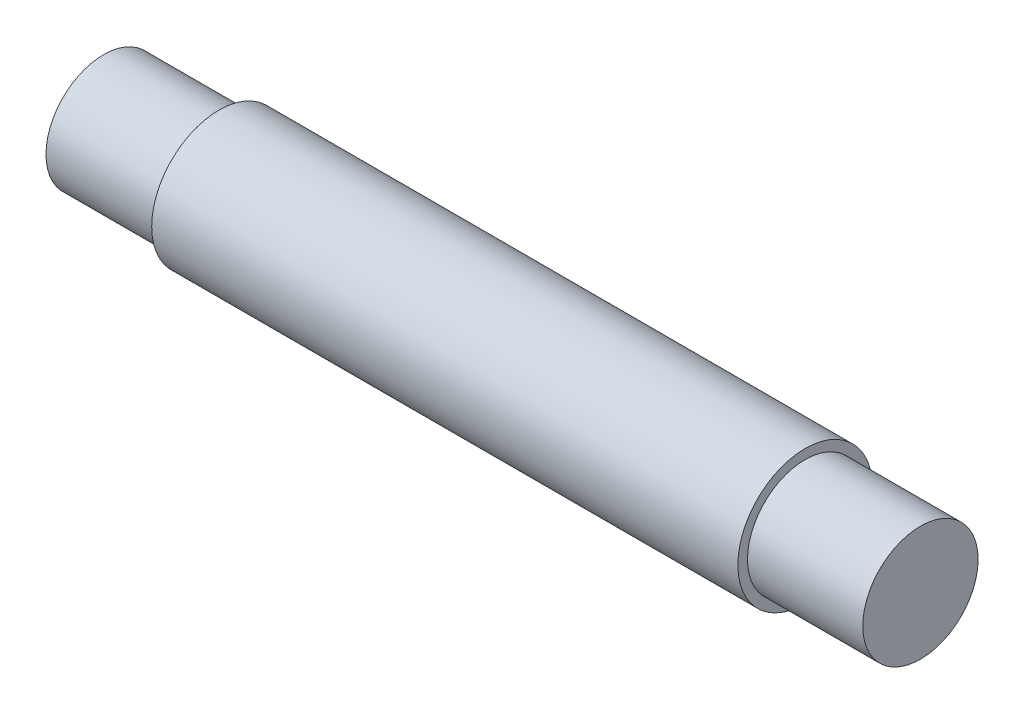
ISO-10303-21;
HEADER;
FILE_DESCRIPTION(('STEP AP214'),'2;1');
FILE_NAME('part.step','',(''),(''),'','','');
FILE_SCHEMA(('AUTOMOTIVE_DESIGN { 1 0 10303 214 1 1 1 1 }'));
ENDSEC;
DATA;
#1=APPLICATION_CONTEXT('core data for automotive mechanical design processes');
#2=APPLICATION_PROTOCOL_DEFINITION('international standard','automotive_design',2000,#1);
#3=PRODUCT_CONTEXT('',#1,'mechanical');
#4=PRODUCT('Part','Part','',(#3));
#5=PRODUCT_RELATED_PRODUCT_CATEGORY('part','',(#4));
#6=PRODUCT_DEFINITION_FORMATION('','',#4);
#7=PRODUCT_DEFINITION_CONTEXT('part definition',#1,'design');
#8=PRODUCT_DEFINITION('design','',#6,#7);
#9=PRODUCT_DEFINITION_SHAPE('','',#8);
#10=(LENGTH_UNIT() NAMED_UNIT(*) SI_UNIT(.MILLI.,.METRE.));
#11=(NAMED_UNIT(*) PLANE_ANGLE_UNIT() SI_UNIT($,.RADIAN.));
#12=(NAMED_UNIT(*) SI_UNIT($,.STERADIAN.) SOLID_ANGLE_UNIT());
#13=UNCERTAINTY_MEASURE_WITH_UNIT(LENGTH_MEASURE(1.E-05),#10,'distance_accuracy_value','');
#14=(GEOMETRIC_REPRESENTATION_CONTEXT(3) GLOBAL_UNCERTAINTY_ASSIGNED_CONTEXT((#13)) GLOBAL_UNIT_ASSIGNED_CONTEXT((#10,
#11,#12)) REPRESENTATION_CONTEXT('',''));
#15=CARTESIAN_POINT('',(0.,0.,0.));
#16=DIRECTION('',(0.,0.,1.));
#17=DIRECTION('',(1.,0.,0.));
#18=AXIS2_PLACEMENT_3D('',#15,#16,#17);
#19=CARTESIAN_POINT('',(85.,0.,0.));
#20=DIRECTION('',(-1.,0.,0.));
#21=DIRECTION('',(0.,0.,1.));
#22=AXIS2_PLACEMENT_3D('',#19,#20,#21);
#23=CYLINDRICAL_SURFACE('',#22,7.);
#24=CARTESIAN_POINT('',(12.,0.,0.));
#25=DIRECTION('',(-1.,0.,0.));
#26=DIRECTION('',(0.,0.,1.));
#27=AXIS2_PLACEMENT_3D('',#24,#25,#26);
#28=CIRCLE('',#27,7.);
#29=CARTESIAN_POINT('',(12.,0.,7.));
#30=VERTEX_POINT('',#29);
#31=EDGE_CURVE('E12',#30,#30,#28,.T.);
#32=ORIENTED_EDGE('',*,*,#31,.F.);
#33=EDGE_LOOP('',(#32));
#34=FACE_BOUND('',#33,.T.);
#35=CARTESIAN_POINT('',(73.,0.,0.));
#36=DIRECTION('',(1.,0.,0.));
#37=DIRECTION('',(0.,0.,-1.));
#38=AXIS2_PLACEMENT_3D('',#35,#36,#37);
#39=CIRCLE('',#38,7.);
#40=CARTESIAN_POINT('',(73.,0.,-7.));
#41=VERTEX_POINT('',#40);
#42=EDGE_CURVE('E50',#41,#41,#39,.T.);
#43=ORIENTED_EDGE('',*,*,#42,.F.);
#44=EDGE_LOOP('',(#43));
#45=FACE_BOUND('',#44,.T.);
#46=ADVANCED_FACE('F47',(#34,#45),#23,.T.);
#47=CARTESIAN_POINT('',(12.,0.,0.));
#48=DIRECTION('',(-1.,0.,0.));
#49=DIRECTION('',(0.,0.,1.));
#50=AXIS2_PLACEMENT_3D('',#47,#48,#49);
#51=PLANE('',#50);
#52=CARTESIAN_POINT('',(12.,0.,0.));
#53=DIRECTION('',(-1.,0.,0.));
#54=DIRECTION('',(0.,0.,1.));
#55=AXIS2_PLACEMENT_3D('',#52,#53,#54);
#56=CIRCLE('',#55,6.);
#57=CARTESIAN_POINT('',(12.,0.,6.));
#58=VERTEX_POINT('',#57);
#59=EDGE_CURVE('E54',#58,#58,#56,.T.);
#60=ORIENTED_EDGE('',*,*,#59,.F.);
#61=EDGE_LOOP('',(#60));
#62=FACE_BOUND('',#61,.T.);
#63=ORIENTED_EDGE('',*,*,#31,.T.);
#64=EDGE_LOOP('',(#63));
#65=FACE_BOUND('',#64,.T.);
#66=ADVANCED_FACE('F76',(#62,#65),#51,.T.);
#67=CARTESIAN_POINT('',(12.,0.,0.));
#68=DIRECTION('',(-1.,0.,0.));
#69=DIRECTION('',(0.,0.,1.));
#70=AXIS2_PLACEMENT_3D('',#67,#68,#69);
#71=CYLINDRICAL_SURFACE('',#70,6.);
#72=ORIENTED_EDGE('',*,*,#59,.T.);
#73=EDGE_LOOP('',(#72));
#74=FACE_BOUND('',#73,.T.);
#75=CARTESIAN_POINT('',(0.,0.,0.));
#76=DIRECTION('',(-1.,0.,0.));
#77=DIRECTION('',(0.,0.,1.));
#78=AXIS2_PLACEMENT_3D('',#75,#76,#77);
#79=CIRCLE('',#78,6.);
#80=CARTESIAN_POINT('',(0.,0.,6.));
#81=VERTEX_POINT('',#80);
#82=EDGE_CURVE('E58',#81,#81,#79,.T.);
#83=ORIENTED_EDGE('',*,*,#82,.F.);
#84=EDGE_LOOP('',(#83));
#85=FACE_BOUND('',#84,.T.);
#86=ADVANCED_FACE('F81',(#74,#85),#71,.T.);
#87=CARTESIAN_POINT('',(0.,0.,0.));
#88=DIRECTION('',(1.,0.,0.));
#89=DIRECTION('',(0.,0.,-1.));
#90=AXIS2_PLACEMENT_3D('',#87,#88,#89);
#91=PLANE('',#90);
#92=ORIENTED_EDGE('',*,*,#82,.T.);
#93=EDGE_LOOP('',(#92));
#94=FACE_BOUND('',#93,.T.);
#95=ADVANCED_FACE('F87',(#94),#91,.F.);
#96=CARTESIAN_POINT('',(73.,0.,0.));
#97=DIRECTION('',(1.,0.,0.));
#98=DIRECTION('',(0.,0.,1.));
#99=AXIS2_PLACEMENT_3D('',#96,#97,#98);
#100=PLANE('',#99);
#101=CARTESIAN_POINT('',(73.,0.,0.));
#102=DIRECTION('',(-1.,0.,0.));
#103=DIRECTION('',(0.,0.,1.));
#104=AXIS2_PLACEMENT_3D('',#101,#102,#103);
#105=CIRCLE('',#104,6.);
#106=CARTESIAN_POINT('',(73.,0.,6.));
#107=VERTEX_POINT('',#106);
#108=EDGE_CURVE('E66',#107,#107,#105,.T.);
#109=ORIENTED_EDGE('',*,*,#108,.T.);
#110=EDGE_LOOP('',(#109));
#111=FACE_BOUND('',#110,.T.);
#112=ORIENTED_EDGE('',*,*,#42,.T.);
#113=EDGE_LOOP('',(#112));
#114=FACE_BOUND('',#113,.T.);
#115=ADVANCED_FACE('F73',(#111,#114),#100,.T.);
#116=CARTESIAN_POINT('',(73.,0.,0.));
#117=DIRECTION('',(1.,0.,0.));
#118=DIRECTION('',(0.,0.,-1.));
#119=AXIS2_PLACEMENT_3D('',#116,#117,#118);
#120=CYLINDRICAL_SURFACE('',#119,6.);
#121=ORIENTED_EDGE('',*,*,#108,.F.);
#122=EDGE_LOOP('',(#121));
#123=FACE_BOUND('',#122,.T.);
#124=CARTESIAN_POINT('',(85.,0.,0.));
#125=DIRECTION('',(-1.,0.,0.));
#126=DIRECTION('',(0.,0.,1.));
#127=AXIS2_PLACEMENT_3D('',#124,#125,#126);
#128=CIRCLE('',#127,6.);
#129=CARTESIAN_POINT('',(85.,0.,6.));
#130=VERTEX_POINT('',#129);
#131=EDGE_CURVE('E63',#130,#130,#128,.T.);
#132=ORIENTED_EDGE('',*,*,#131,.T.);
#133=EDGE_LOOP('',(#132));
#134=FACE_BOUND('',#133,.T.);
#135=ADVANCED_FACE('F95',(#123,#134),#120,.T.);
#136=CARTESIAN_POINT('',(85.,0.,0.));
#137=DIRECTION('',(1.,0.,0.));
#138=DIRECTION('',(0.,0.,-1.));
#139=AXIS2_PLACEMENT_3D('',#136,#137,#138);
#140=PLANE('',#139);
#141=ORIENTED_EDGE('',*,*,#131,.F.);
#142=EDGE_LOOP('',(#141));
#143=FACE_BOUND('',#142,.T.);
#144=ADVANCED_FACE('F93',(#143),#140,.T.);
#145=CLOSED_SHELL('',(#46,#66,#86,#95,#115,#135,#144));
#146=MANIFOLD_SOLID_BREP('B2',#145);
#147=ADVANCED_BREP_SHAPE_REPRESENTATION('',(#18,#146),#14);
#148=SHAPE_DEFINITION_REPRESENTATION(#9,#147);
ENDSEC;
END-ISO-10303-21;
